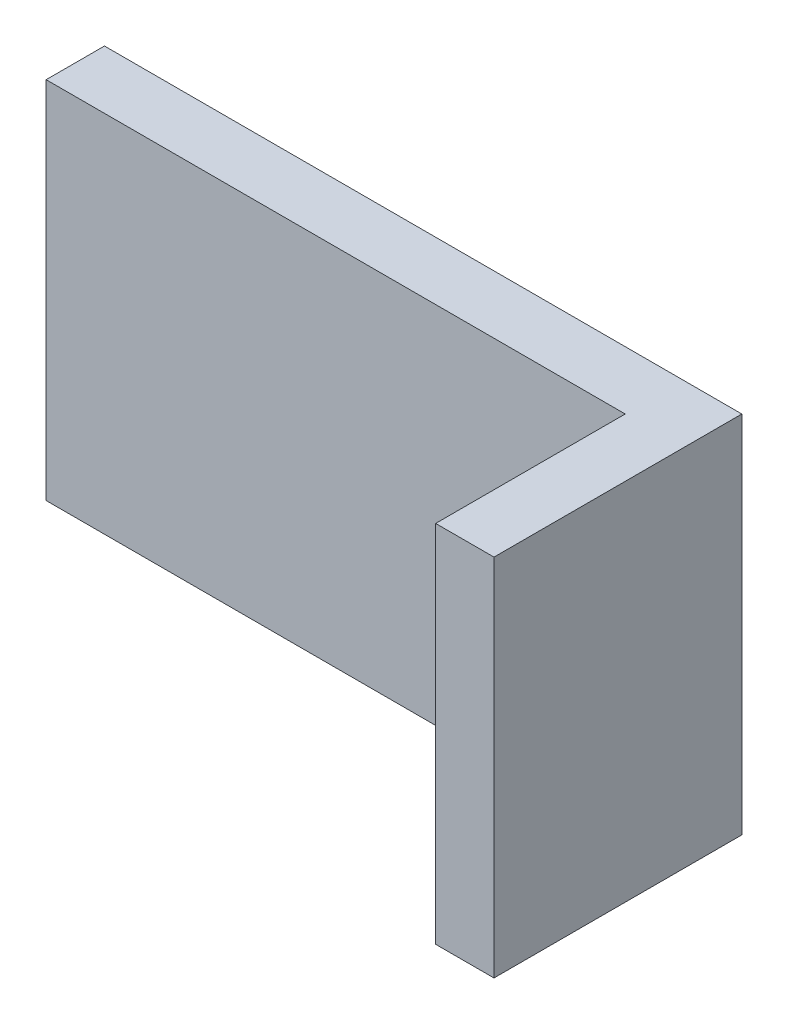
ISO-10303-21;
HEADER;
FILE_DESCRIPTION(('STEP AP214'),'2;1');
FILE_NAME('part.step','',(''),(''),'','','');
FILE_SCHEMA(('AUTOMOTIVE_DESIGN { 1 0 10303 214 1 1 1 1 }'));
ENDSEC;
DATA;
#1=APPLICATION_CONTEXT('core data for automotive mechanical design processes');
#2=APPLICATION_PROTOCOL_DEFINITION('international standard','automotive_design',2000,#1);
#3=PRODUCT_CONTEXT('',#1,'mechanical');
#4=PRODUCT('Part','Part','',(#3));
#5=PRODUCT_RELATED_PRODUCT_CATEGORY('part','',(#4));
#6=PRODUCT_DEFINITION_FORMATION('','',#4);
#7=PRODUCT_DEFINITION_CONTEXT('part definition',#1,'design');
#8=PRODUCT_DEFINITION('design','',#6,#7);
#9=PRODUCT_DEFINITION_SHAPE('','',#8);
#10=(LENGTH_UNIT() NAMED_UNIT(*) SI_UNIT(.MILLI.,.METRE.));
#11=(NAMED_UNIT(*) PLANE_ANGLE_UNIT() SI_UNIT($,.RADIAN.));
#12=(NAMED_UNIT(*) SI_UNIT($,.STERADIAN.) SOLID_ANGLE_UNIT());
#13=UNCERTAINTY_MEASURE_WITH_UNIT(LENGTH_MEASURE(1.E-05),#10,'distance_accuracy_value','');
#14=(GEOMETRIC_REPRESENTATION_CONTEXT(3) GLOBAL_UNCERTAINTY_ASSIGNED_CONTEXT((#13)) GLOBAL_UNIT_ASSIGNED_CONTEXT((#10,
#11,#12)) REPRESENTATION_CONTEXT('',''));
#15=CARTESIAN_POINT('',(0.,0.,0.));
#16=DIRECTION('',(0.,0.,1.));
#17=DIRECTION('',(1.,0.,0.));
#18=AXIS2_PLACEMENT_3D('',#15,#16,#17);
#19=CARTESIAN_POINT('',(0.,25.,26.));
#20=DIRECTION('',(1.,0.,0.));
#21=DIRECTION('',(0.,0.,-1.));
#22=AXIS2_PLACEMENT_3D('',#19,#20,#21);
#23=PLANE('',#22);
#24=DIRECTION('',(0.,0.,1.));
#25=VECTOR('',#24,1.);
#26=CARTESIAN_POINT('',(0.,-25.,26.));
#27=LINE('',#26,#25);
#28=CARTESIAN_POINT('',(0.,-25.,0.));
#29=VERTEX_POINT('',#28);
#30=CARTESIAN_POINT('',(0.,-25.,26.));
#31=VERTEX_POINT('',#30);
#32=EDGE_CURVE('E128',#29,#31,#27,.T.);
#33=ORIENTED_EDGE('',*,*,#32,.T.);
#34=DIRECTION('',(0.,-1.,0.));
#35=VECTOR('',#34,1.);
#36=CARTESIAN_POINT('',(0.,25.,26.));
#37=LINE('',#36,#35);
#38=CARTESIAN_POINT('',(0.,25.,26.));
#39=VERTEX_POINT('',#38);
#40=EDGE_CURVE('E11',#39,#31,#37,.T.);
#41=ORIENTED_EDGE('',*,*,#40,.F.);
#42=DIRECTION('',(0.,0.,1.));
#43=VECTOR('',#42,1.);
#44=CARTESIAN_POINT('',(0.,25.,26.));
#45=LINE('',#44,#43);
#46=CARTESIAN_POINT('',(0.,25.,0.));
#47=VERTEX_POINT('',#46);
#48=EDGE_CURVE('E144',#47,#39,#45,.T.);
#49=ORIENTED_EDGE('',*,*,#48,.F.);
#50=DIRECTION('',(0.,-1.,0.));
#51=VECTOR('',#50,1.);
#52=CARTESIAN_POINT('',(0.,25.,0.));
#53=LINE('',#52,#51);
#54=EDGE_CURVE('E124',#47,#29,#53,.T.);
#55=ORIENTED_EDGE('',*,*,#54,.T.);
#56=EDGE_LOOP('',(#33,#41,#49,#55));
#57=FACE_BOUND('',#56,.T.);
#58=ADVANCED_FACE('F39',(#57),#23,.F.);
#59=CARTESIAN_POINT('',(8.,25.,26.));
#60=DIRECTION('',(0.,0.,-1.));
#61=DIRECTION('',(-1.,0.,0.));
#62=AXIS2_PLACEMENT_3D('',#59,#60,#61);
#63=PLANE('',#62);
#64=DIRECTION('',(1.,0.,0.));
#65=VECTOR('',#64,1.);
#66=CARTESIAN_POINT('',(8.,-25.,26.));
#67=LINE('',#66,#65);
#68=CARTESIAN_POINT('',(8.,-25.,26.));
#69=VERTEX_POINT('',#68);
#70=EDGE_CURVE('E132',#31,#69,#67,.T.);
#71=ORIENTED_EDGE('',*,*,#70,.T.);
#72=DIRECTION('',(0.,-1.,0.));
#73=VECTOR('',#72,1.);
#74=CARTESIAN_POINT('',(8.,25.,26.));
#75=LINE('',#74,#73);
#76=CARTESIAN_POINT('',(8.,25.,26.));
#77=VERTEX_POINT('',#76);
#78=EDGE_CURVE('E48',#77,#69,#75,.T.);
#79=ORIENTED_EDGE('',*,*,#78,.F.);
#80=DIRECTION('',(1.,0.,0.));
#81=VECTOR('',#80,1.);
#82=CARTESIAN_POINT('',(8.,25.,26.));
#83=LINE('',#82,#81);
#84=EDGE_CURVE('E93',#39,#77,#83,.T.);
#85=ORIENTED_EDGE('',*,*,#84,.F.);
#86=ORIENTED_EDGE('',*,*,#40,.T.);
#87=EDGE_LOOP('',(#71,#79,#85,#86));
#88=FACE_BOUND('',#87,.T.);
#89=ADVANCED_FACE('F172',(#88),#63,.F.);
#90=CARTESIAN_POINT('',(8.00000000000001,25.,-7.99999999999999));
#91=DIRECTION('',(-1.,0.,0.));
#92=DIRECTION('',(0.,0.,1.));
#93=AXIS2_PLACEMENT_3D('',#90,#91,#92);
#94=PLANE('',#93);
#95=DIRECTION('',(0.,0.,-1.));
#96=VECTOR('',#95,1.);
#97=CARTESIAN_POINT('',(8.00000000000001,-25.,-7.99999999999999));
#98=LINE('',#97,#96);
#99=CARTESIAN_POINT('',(8.00000000000001,-25.,-7.99999999999999));
#100=VERTEX_POINT('',#99);
#101=EDGE_CURVE('E135',#69,#100,#98,.T.);
#102=ORIENTED_EDGE('',*,*,#101,.T.);
#103=DIRECTION('',(0.,-1.,0.));
#104=VECTOR('',#103,1.);
#105=CARTESIAN_POINT('',(8.00000000000001,25.,-7.99999999999999));
#106=LINE('',#105,#104);
#107=CARTESIAN_POINT('',(8.00000000000001,25.,-7.99999999999999));
#108=VERTEX_POINT('',#107);
#109=EDGE_CURVE('E117',#108,#100,#106,.T.);
#110=ORIENTED_EDGE('',*,*,#109,.F.);
#111=DIRECTION('',(0.,0.,-1.));
#112=VECTOR('',#111,1.);
#113=CARTESIAN_POINT('',(8.00000000000001,25.,-7.99999999999999));
#114=LINE('',#113,#112);
#115=EDGE_CURVE('E106',#77,#108,#114,.T.);
#116=ORIENTED_EDGE('',*,*,#115,.F.);
#117=ORIENTED_EDGE('',*,*,#78,.T.);
#118=EDGE_LOOP('',(#102,#110,#116,#117));
#119=FACE_BOUND('',#118,.T.);
#120=ADVANCED_FACE('F154',(#119),#94,.F.);
#121=CARTESIAN_POINT('',(-79.4285714285715,25.,-8.));
#122=DIRECTION('',(0.,0.,1.));
#123=DIRECTION('',(1.,0.,0.));
#124=AXIS2_PLACEMENT_3D('',#121,#122,#123);
#125=PLANE('',#124);
#126=DIRECTION('',(-1.,0.,0.));
#127=VECTOR('',#126,1.);
#128=CARTESIAN_POINT('',(-79.4285714285715,-25.,-8.));
#129=LINE('',#128,#127);
#130=CARTESIAN_POINT('',(-79.4285714285715,-25.,-8.));
#131=VERTEX_POINT('',#130);
#132=EDGE_CURVE('E115',#100,#131,#129,.T.);
#133=ORIENTED_EDGE('',*,*,#132,.T.);
#134=DIRECTION('',(0.,-1.,0.));
#135=VECTOR('',#134,1.);
#136=CARTESIAN_POINT('',(-79.4285714285715,25.,-8.));
#137=LINE('',#136,#135);
#138=CARTESIAN_POINT('',(-79.4285714285715,25.,-8.));
#139=VERTEX_POINT('',#138);
#140=EDGE_CURVE('E112',#139,#131,#137,.T.);
#141=ORIENTED_EDGE('',*,*,#140,.F.);
#142=DIRECTION('',(-1.,0.,0.));
#143=VECTOR('',#142,1.);
#144=CARTESIAN_POINT('',(-79.4285714285715,25.,-8.));
#145=LINE('',#144,#143);
#146=EDGE_CURVE('E100',#108,#139,#145,.T.);
#147=ORIENTED_EDGE('',*,*,#146,.F.);
#148=ORIENTED_EDGE('',*,*,#109,.T.);
#149=EDGE_LOOP('',(#133,#141,#147,#148));
#150=FACE_BOUND('',#149,.T.);
#151=ADVANCED_FACE('F113',(#150),#125,.F.);
#152=CARTESIAN_POINT('',(-79.4285714285715,25.,0.));
#153=DIRECTION('',(1.,0.,0.));
#154=DIRECTION('',(0.,0.,-1.));
#155=AXIS2_PLACEMENT_3D('',#152,#153,#154);
#156=PLANE('',#155);
#157=DIRECTION('',(0.,0.,1.));
#158=VECTOR('',#157,1.);
#159=CARTESIAN_POINT('',(-79.4285714285715,-25.,0.));
#160=LINE('',#159,#158);
#161=CARTESIAN_POINT('',(-79.4285714285715,-25.,0.));
#162=VERTEX_POINT('',#161);
#163=EDGE_CURVE('E79',#131,#162,#160,.T.);
#164=ORIENTED_EDGE('',*,*,#163,.T.);
#165=DIRECTION('',(0.,-1.,0.));
#166=VECTOR('',#165,1.);
#167=CARTESIAN_POINT('',(-79.4285714285715,25.,0.));
#168=LINE('',#167,#166);
#169=CARTESIAN_POINT('',(-79.4285714285715,25.,0.));
#170=VERTEX_POINT('',#169);
#171=EDGE_CURVE('E118',#170,#162,#168,.T.);
#172=ORIENTED_EDGE('',*,*,#171,.F.);
#173=DIRECTION('',(0.,0.,1.));
#174=VECTOR('',#173,1.);
#175=CARTESIAN_POINT('',(-79.4285714285715,25.,0.));
#176=LINE('',#175,#174);
#177=EDGE_CURVE('E104',#139,#170,#176,.T.);
#178=ORIENTED_EDGE('',*,*,#177,.F.);
#179=ORIENTED_EDGE('',*,*,#140,.T.);
#180=EDGE_LOOP('',(#164,#172,#178,#179));
#181=FACE_BOUND('',#180,.T.);
#182=ADVANCED_FACE('F120',(#181),#156,.F.);
#183=CARTESIAN_POINT('',(0.,25.,0.));
#184=DIRECTION('',(0.,0.,-1.));
#185=DIRECTION('',(-1.,0.,0.));
#186=AXIS2_PLACEMENT_3D('',#183,#184,#185);
#187=PLANE('',#186);
#188=DIRECTION('',(1.,0.,0.));
#189=VECTOR('',#188,1.);
#190=CARTESIAN_POINT('',(0.,-25.,0.));
#191=LINE('',#190,#189);
#192=EDGE_CURVE('E85',#162,#29,#191,.T.);
#193=ORIENTED_EDGE('',*,*,#192,.T.);
#194=ORIENTED_EDGE('',*,*,#54,.F.);
#195=DIRECTION('',(1.,0.,0.));
#196=VECTOR('',#195,1.);
#197=CARTESIAN_POINT('',(0.,25.,0.));
#198=LINE('',#197,#196);
#199=EDGE_CURVE('E56',#170,#47,#198,.T.);
#200=ORIENTED_EDGE('',*,*,#199,.F.);
#201=ORIENTED_EDGE('',*,*,#171,.T.);
#202=EDGE_LOOP('',(#193,#194,#200,#201));
#203=FACE_BOUND('',#202,.T.);
#204=ADVANCED_FACE('F161',(#203),#187,.F.);
#205=CARTESIAN_POINT('',(0.,25.,0.));
#206=DIRECTION('',(0.,1.,0.));
#207=DIRECTION('',(0.,0.,1.));
#208=AXIS2_PLACEMENT_3D('',#205,#206,#207);
#209=PLANE('',#208);
#210=ORIENTED_EDGE('',*,*,#48,.T.);
#211=ORIENTED_EDGE('',*,*,#84,.T.);
#212=ORIENTED_EDGE('',*,*,#115,.T.);
#213=ORIENTED_EDGE('',*,*,#146,.T.);
#214=ORIENTED_EDGE('',*,*,#177,.T.);
#215=ORIENTED_EDGE('',*,*,#199,.T.);
#216=EDGE_LOOP('',(#210,#211,#212,#213,#214,#215));
#217=FACE_BOUND('',#216,.T.);
#218=ADVANCED_FACE('F102',(#217),#209,.T.);
#219=CARTESIAN_POINT('',(0.,-25.,0.));
#220=DIRECTION('',(0.,1.,0.));
#221=DIRECTION('',(0.,0.,1.));
#222=AXIS2_PLACEMENT_3D('',#219,#220,#221);
#223=PLANE('',#222);
#224=ORIENTED_EDGE('',*,*,#32,.F.);
#225=ORIENTED_EDGE('',*,*,#192,.F.);
#226=ORIENTED_EDGE('',*,*,#163,.F.);
#227=ORIENTED_EDGE('',*,*,#132,.F.);
#228=ORIENTED_EDGE('',*,*,#101,.F.);
#229=ORIENTED_EDGE('',*,*,#70,.F.);
#230=EDGE_LOOP('',(#224,#225,#226,#227,#228,#229));
#231=FACE_BOUND('',#230,.T.);
#232=ADVANCED_FACE('F157',(#231),#223,.F.);
#233=CLOSED_SHELL('',(#58,#89,#120,#151,#182,#204,#218,#232));
#234=MANIFOLD_SOLID_BREP('B2',#233);
#235=ADVANCED_BREP_SHAPE_REPRESENTATION('',(#18,#234),#14);
#236=SHAPE_DEFINITION_REPRESENTATION(#9,#235);
ENDSEC;
END-ISO-10303-21;
